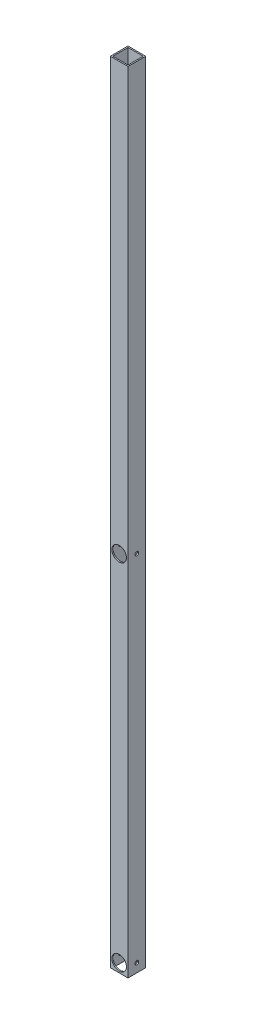
ISO-10303-21;
HEADER;
FILE_DESCRIPTION(('STEP AP214'),'2;1');
FILE_NAME('part.step','',(''),(''),'','','');
FILE_SCHEMA(('AUTOMOTIVE_DESIGN { 1 0 10303 214 1 1 1 1 }'));
ENDSEC;
DATA;
#1=APPLICATION_CONTEXT('core data for automotive mechanical design processes');
#2=APPLICATION_PROTOCOL_DEFINITION('international standard','automotive_design',2000,#1);
#3=PRODUCT_CONTEXT('',#1,'mechanical');
#4=PRODUCT('Part','Part','',(#3));
#5=PRODUCT_RELATED_PRODUCT_CATEGORY('part','',(#4));
#6=PRODUCT_DEFINITION_FORMATION('','',#4);
#7=PRODUCT_DEFINITION_CONTEXT('part definition',#1,'design');
#8=PRODUCT_DEFINITION('design','',#6,#7);
#9=PRODUCT_DEFINITION_SHAPE('','',#8);
#10=(LENGTH_UNIT() NAMED_UNIT(*) SI_UNIT(.MILLI.,.METRE.));
#11=(NAMED_UNIT(*) PLANE_ANGLE_UNIT() SI_UNIT($,.RADIAN.));
#12=(NAMED_UNIT(*) SI_UNIT($,.STERADIAN.) SOLID_ANGLE_UNIT());
#13=UNCERTAINTY_MEASURE_WITH_UNIT(LENGTH_MEASURE(1.E-05),#10,'distance_accuracy_value','');
#14=(GEOMETRIC_REPRESENTATION_CONTEXT(3) GLOBAL_UNCERTAINTY_ASSIGNED_CONTEXT((#13)) GLOBAL_UNIT_ASSIGNED_CONTEXT((#10,
#11,#12)) REPRESENTATION_CONTEXT('',''));
#15=CARTESIAN_POINT('',(0.,0.,0.));
#16=DIRECTION('',(0.,0.,1.));
#17=DIRECTION('',(1.,0.,0.));
#18=AXIS2_PLACEMENT_3D('',#15,#16,#17);
#19=CARTESIAN_POINT('',(0.,1981.2,0.));
#20=DIRECTION('',(0.,-1.,0.));
#21=DIRECTION('',(0.,0.,-1.));
#22=AXIS2_PLACEMENT_3D('',#19,#20,#21);
#23=PLANE('',#22);
#24=DIRECTION('',(0.,0.,1.));
#25=VECTOR('',#24,1.);
#26=CARTESIAN_POINT('',(0.,1981.2,0.));
#27=LINE('',#26,#25);
#28=CARTESIAN_POINT('',(0.,1981.2,-44.45));
#29=VERTEX_POINT('',#28);
#30=CARTESIAN_POINT('',(0.,1981.2,0.));
#31=VERTEX_POINT('',#30);
#32=EDGE_CURVE('E141',#29,#31,#27,.T.);
#33=ORIENTED_EDGE('',*,*,#32,.T.);
#34=DIRECTION('',(1.,0.,0.));
#35=VECTOR('',#34,1.);
#36=CARTESIAN_POINT('',(0.,1981.2,0.));
#37=LINE('',#36,#35);
#38=CARTESIAN_POINT('',(44.45,1981.2,0.));
#39=VERTEX_POINT('',#38);
#40=EDGE_CURVE('E144',#31,#39,#37,.T.);
#41=ORIENTED_EDGE('',*,*,#40,.T.);
#42=DIRECTION('',(0.,0.,-1.));
#43=VECTOR('',#42,1.);
#44=CARTESIAN_POINT('',(44.45,1981.2,0.));
#45=LINE('',#44,#43);
#46=CARTESIAN_POINT('',(44.45,1981.2,-44.45));
#47=VERTEX_POINT('',#46);
#48=EDGE_CURVE('E147',#39,#47,#45,.T.);
#49=ORIENTED_EDGE('',*,*,#48,.T.);
#50=DIRECTION('',(-1.,0.,0.));
#51=VECTOR('',#50,1.);
#52=CARTESIAN_POINT('',(0.,1981.2,-44.45));
#53=LINE('',#52,#51);
#54=EDGE_CURVE('E149',#47,#29,#53,.T.);
#55=ORIENTED_EDGE('',*,*,#54,.T.);
#56=EDGE_LOOP('',(#33,#41,#49,#55));
#57=FACE_BOUND('',#56,.T.);
#58=DIRECTION('',(1.,0.,0.));
#59=VECTOR('',#58,1.);
#60=CARTESIAN_POINT('',(3.175,1981.2,-3.175));
#61=LINE('',#60,#59);
#62=CARTESIAN_POINT('',(3.175,1981.2,-3.175));
#63=VERTEX_POINT('',#62);
#64=CARTESIAN_POINT('',(41.275,1981.2,-3.175));
#65=VERTEX_POINT('',#64);
#66=EDGE_CURVE('E103',#63,#65,#61,.T.);
#67=ORIENTED_EDGE('',*,*,#66,.F.);
#68=DIRECTION('',(0.,0.,1.));
#69=VECTOR('',#68,1.);
#70=CARTESIAN_POINT('',(3.175,1981.2,-3.175));
#71=LINE('',#70,#69);
#72=CARTESIAN_POINT('',(3.175,1981.2,-41.275));
#73=VERTEX_POINT('',#72);
#74=EDGE_CURVE('E125',#73,#63,#71,.T.);
#75=ORIENTED_EDGE('',*,*,#74,.F.);
#76=DIRECTION('',(-1.,0.,0.));
#77=VECTOR('',#76,1.);
#78=CARTESIAN_POINT('',(3.175,1981.2,-41.275));
#79=LINE('',#78,#77);
#80=CARTESIAN_POINT('',(41.275,1981.2,-41.275));
#81=VERTEX_POINT('',#80);
#82=EDGE_CURVE('E123',#81,#73,#79,.T.);
#83=ORIENTED_EDGE('',*,*,#82,.F.);
#84=DIRECTION('',(0.,0.,-1.));
#85=VECTOR('',#84,1.);
#86=CARTESIAN_POINT('',(41.275,1981.2,-3.175));
#87=LINE('',#86,#85);
#88=EDGE_CURVE('E111',#65,#81,#87,.T.);
#89=ORIENTED_EDGE('',*,*,#88,.F.);
#90=EDGE_LOOP('',(#67,#75,#83,#89));
#91=FACE_BOUND('',#90,.T.);
#92=ADVANCED_FACE('F36',(#57,#91),#23,.F.);
#93=CARTESIAN_POINT('',(0.,0.,0.));
#94=DIRECTION('',(0.,-1.,0.));
#95=DIRECTION('',(0.,0.,-1.));
#96=AXIS2_PLACEMENT_3D('',#93,#94,#95);
#97=PLANE('',#96);
#98=DIRECTION('',(0.,0.,1.));
#99=VECTOR('',#98,1.);
#100=CARTESIAN_POINT('',(0.,0.,0.));
#101=LINE('',#100,#99);
#102=CARTESIAN_POINT('',(0.,0.,-44.45));
#103=VERTEX_POINT('',#102);
#104=CARTESIAN_POINT('',(0.,0.,0.));
#105=VERTEX_POINT('',#104);
#106=EDGE_CURVE('E119',#103,#105,#101,.T.);
#107=ORIENTED_EDGE('',*,*,#106,.F.);
#108=DIRECTION('',(-1.,0.,0.));
#109=VECTOR('',#108,1.);
#110=CARTESIAN_POINT('',(0.,0.,-44.45));
#111=LINE('',#110,#109);
#112=CARTESIAN_POINT('',(44.45,0.,-44.45));
#113=VERTEX_POINT('',#112);
#114=EDGE_CURVE('E145',#113,#103,#111,.T.);
#115=ORIENTED_EDGE('',*,*,#114,.F.);
#116=DIRECTION('',(0.,0.,-1.));
#117=VECTOR('',#116,1.);
#118=CARTESIAN_POINT('',(44.45,0.,0.));
#119=LINE('',#118,#117);
#120=CARTESIAN_POINT('',(44.45,0.,0.));
#121=VERTEX_POINT('',#120);
#122=EDGE_CURVE('E156',#121,#113,#119,.T.);
#123=ORIENTED_EDGE('',*,*,#122,.F.);
#124=DIRECTION('',(1.,0.,0.));
#125=VECTOR('',#124,1.);
#126=CARTESIAN_POINT('',(0.,0.,0.));
#127=LINE('',#126,#125);
#128=EDGE_CURVE('E154',#105,#121,#127,.T.);
#129=ORIENTED_EDGE('',*,*,#128,.F.);
#130=EDGE_LOOP('',(#107,#115,#123,#129));
#131=FACE_BOUND('',#130,.T.);
#132=DIRECTION('',(0.,0.,1.));
#133=VECTOR('',#132,1.);
#134=CARTESIAN_POINT('',(3.175,0.,-3.175));
#135=LINE('',#134,#133);
#136=CARTESIAN_POINT('',(3.175,0.,-41.275));
#137=VERTEX_POINT('',#136);
#138=CARTESIAN_POINT('',(3.175,0.,-3.175));
#139=VERTEX_POINT('',#138);
#140=EDGE_CURVE('E112',#137,#139,#135,.T.);
#141=ORIENTED_EDGE('',*,*,#140,.T.);
#142=DIRECTION('',(1.,0.,0.));
#143=VECTOR('',#142,1.);
#144=CARTESIAN_POINT('',(3.175,0.,-3.175));
#145=LINE('',#144,#143);
#146=CARTESIAN_POINT('',(41.275,0.,-3.175));
#147=VERTEX_POINT('',#146);
#148=EDGE_CURVE('E61',#139,#147,#145,.T.);
#149=ORIENTED_EDGE('',*,*,#148,.T.);
#150=DIRECTION('',(0.,0.,-1.));
#151=VECTOR('',#150,1.);
#152=CARTESIAN_POINT('',(41.275,0.,-3.175));
#153=LINE('',#152,#151);
#154=CARTESIAN_POINT('',(41.275,0.,-41.275));
#155=VERTEX_POINT('',#154);
#156=EDGE_CURVE('E118',#147,#155,#153,.T.);
#157=ORIENTED_EDGE('',*,*,#156,.T.);
#158=DIRECTION('',(-1.,0.,0.));
#159=VECTOR('',#158,1.);
#160=CARTESIAN_POINT('',(3.175,0.,-41.275));
#161=LINE('',#160,#159);
#162=EDGE_CURVE('E133',#155,#137,#161,.T.);
#163=ORIENTED_EDGE('',*,*,#162,.T.);
#164=EDGE_LOOP('',(#141,#149,#157,#163));
#165=FACE_BOUND('',#164,.T.);
#166=ADVANCED_FACE('F244',(#131,#165),#97,.T.);
#167=CARTESIAN_POINT('',(0.,1981.2,0.));
#168=DIRECTION('',(1.,0.,0.));
#169=DIRECTION('',(0.,0.,-1.));
#170=AXIS2_PLACEMENT_3D('',#167,#168,#169);
#171=PLANE('',#170);
#172=CARTESIAN_POINT('',(0.,22.2249999999999,-22.225));
#173=DIRECTION('',(1.,0.,0.));
#174=DIRECTION('',(0.,0.,-1.));
#175=AXIS2_PLACEMENT_3D('',#172,#173,#174);
#176=CIRCLE('',#175,4.7625);
#177=CARTESIAN_POINT('',(0.,22.2249999999999,-26.9875));
#178=VERTEX_POINT('',#177);
#179=EDGE_CURVE('E176',#178,#178,#176,.T.);
#180=ORIENTED_EDGE('',*,*,#179,.T.);
#181=EDGE_LOOP('',(#180));
#182=FACE_BOUND('',#181,.T.);
#183=CARTESIAN_POINT('',(0.,911.225,-22.225));
#184=DIRECTION('',(1.,0.,0.));
#185=DIRECTION('',(0.,0.,-1.));
#186=AXIS2_PLACEMENT_3D('',#183,#184,#185);
#187=CIRCLE('',#186,4.76250000000002);
#188=CARTESIAN_POINT('',(0.,911.225,-26.9875));
#189=VERTEX_POINT('',#188);
#190=EDGE_CURVE('E187',#189,#189,#187,.T.);
#191=ORIENTED_EDGE('',*,*,#190,.T.);
#192=EDGE_LOOP('',(#191));
#193=FACE_BOUND('',#192,.T.);
#194=ORIENTED_EDGE('',*,*,#106,.T.);
#195=DIRECTION('',(0.,-1.,0.));
#196=VECTOR('',#195,1.);
#197=CARTESIAN_POINT('',(0.,1981.2,0.));
#198=LINE('',#197,#196);
#199=EDGE_CURVE('E11',#31,#105,#198,.T.);
#200=ORIENTED_EDGE('',*,*,#199,.F.);
#201=ORIENTED_EDGE('',*,*,#32,.F.);
#202=DIRECTION('',(0.,-1.,0.));
#203=VECTOR('',#202,1.);
#204=CARTESIAN_POINT('',(0.,1981.2,-44.45));
#205=LINE('',#204,#203);
#206=EDGE_CURVE('E151',#29,#103,#205,.T.);
#207=ORIENTED_EDGE('',*,*,#206,.T.);
#208=EDGE_LOOP('',(#194,#200,#201,#207));
#209=FACE_BOUND('',#208,.T.);
#210=ADVANCED_FACE('F38',(#182,#193,#209),#171,.F.);
#211=CARTESIAN_POINT('',(0.,1981.2,0.));
#212=DIRECTION('',(0.,0.,-1.));
#213=DIRECTION('',(-1.,0.,0.));
#214=AXIS2_PLACEMENT_3D('',#211,#212,#213);
#215=PLANE('',#214);
#216=CARTESIAN_POINT('',(22.225,22.2249999999999,0.));
#217=DIRECTION('',(0.,0.,1.));
#218=DIRECTION('',(1.,0.,0.));
#219=AXIS2_PLACEMENT_3D('',#216,#217,#218);
#220=CIRCLE('',#219,18.25625);
#221=CARTESIAN_POINT('',(40.48125,22.2249999999999,0.));
#222=VERTEX_POINT('',#221);
#223=EDGE_CURVE('E201',#222,#222,#220,.T.);
#224=ORIENTED_EDGE('',*,*,#223,.F.);
#225=EDGE_LOOP('',(#224));
#226=FACE_BOUND('',#225,.T.);
#227=CARTESIAN_POINT('',(22.225,911.225,0.));
#228=DIRECTION('',(0.,0.,1.));
#229=DIRECTION('',(1.,0.,0.));
#230=AXIS2_PLACEMENT_3D('',#227,#228,#229);
#231=CIRCLE('',#230,18.25625);
#232=CARTESIAN_POINT('',(40.48125,911.225,0.));
#233=VERTEX_POINT('',#232);
#234=EDGE_CURVE('E198',#233,#233,#231,.T.);
#235=ORIENTED_EDGE('',*,*,#234,.F.);
#236=EDGE_LOOP('',(#235));
#237=FACE_BOUND('',#236,.T.);
#238=ORIENTED_EDGE('',*,*,#128,.T.);
#239=DIRECTION('',(0.,-1.,0.));
#240=VECTOR('',#239,1.);
#241=CARTESIAN_POINT('',(44.45,1981.2,0.));
#242=LINE('',#241,#240);
#243=EDGE_CURVE('E45',#39,#121,#242,.T.);
#244=ORIENTED_EDGE('',*,*,#243,.F.);
#245=ORIENTED_EDGE('',*,*,#40,.F.);
#246=ORIENTED_EDGE('',*,*,#199,.T.);
#247=EDGE_LOOP('',(#238,#244,#245,#246));
#248=FACE_BOUND('',#247,.T.);
#249=ADVANCED_FACE('F230',(#226,#237,#248),#215,.F.);
#250=CARTESIAN_POINT('',(44.45,1981.2,0.));
#251=DIRECTION('',(-1.,0.,0.));
#252=DIRECTION('',(0.,0.,1.));
#253=AXIS2_PLACEMENT_3D('',#250,#251,#252);
#254=PLANE('',#253);
#255=CARTESIAN_POINT('',(44.45,22.2249999999999,-22.225));
#256=DIRECTION('',(1.,0.,0.));
#257=DIRECTION('',(0.,0.,-1.));
#258=AXIS2_PLACEMENT_3D('',#255,#256,#257);
#259=CIRCLE('',#258,4.7625);
#260=CARTESIAN_POINT('',(44.45,22.2249999999999,-26.9875));
#261=VERTEX_POINT('',#260);
#262=EDGE_CURVE('E182',#261,#261,#259,.T.);
#263=ORIENTED_EDGE('',*,*,#262,.F.);
#264=EDGE_LOOP('',(#263));
#265=FACE_BOUND('',#264,.T.);
#266=CARTESIAN_POINT('',(44.45,911.225,-22.225));
#267=DIRECTION('',(1.,0.,0.));
#268=DIRECTION('',(0.,0.,-1.));
#269=AXIS2_PLACEMENT_3D('',#266,#267,#268);
#270=CIRCLE('',#269,4.76250000000002);
#271=CARTESIAN_POINT('',(44.45,911.225,-26.9875));
#272=VERTEX_POINT('',#271);
#273=EDGE_CURVE('E192',#272,#272,#270,.T.);
#274=ORIENTED_EDGE('',*,*,#273,.F.);
#275=EDGE_LOOP('',(#274));
#276=FACE_BOUND('',#275,.T.);
#277=ORIENTED_EDGE('',*,*,#122,.T.);
#278=DIRECTION('',(0.,-1.,0.));
#279=VECTOR('',#278,1.);
#280=CARTESIAN_POINT('',(44.45,1981.2,-44.45));
#281=LINE('',#280,#279);
#282=EDGE_CURVE('E161',#47,#113,#281,.T.);
#283=ORIENTED_EDGE('',*,*,#282,.F.);
#284=ORIENTED_EDGE('',*,*,#48,.F.);
#285=ORIENTED_EDGE('',*,*,#243,.T.);
#286=EDGE_LOOP('',(#277,#283,#284,#285));
#287=FACE_BOUND('',#286,.T.);
#288=ADVANCED_FACE('F233',(#265,#276,#287),#254,.F.);
#289=CARTESIAN_POINT('',(0.,1981.2,-44.45));
#290=DIRECTION('',(0.,0.,1.));
#291=DIRECTION('',(1.,0.,0.));
#292=AXIS2_PLACEMENT_3D('',#289,#290,#291);
#293=PLANE('',#292);
#294=CARTESIAN_POINT('',(22.225,22.2249999999999,-44.45));
#295=DIRECTION('',(0.,0.,1.));
#296=DIRECTION('',(1.,0.,0.));
#297=AXIS2_PLACEMENT_3D('',#294,#295,#296);
#298=CIRCLE('',#297,18.25625);
#299=CARTESIAN_POINT('',(40.48125,22.2249999999999,-44.45));
#300=VERTEX_POINT('',#299);
#301=EDGE_CURVE('E170',#300,#300,#298,.T.);
#302=ORIENTED_EDGE('',*,*,#301,.T.);
#303=EDGE_LOOP('',(#302));
#304=FACE_BOUND('',#303,.T.);
#305=CARTESIAN_POINT('',(22.225,911.225,-44.45));
#306=DIRECTION('',(0.,0.,1.));
#307=DIRECTION('',(1.,0.,0.));
#308=AXIS2_PLACEMENT_3D('',#305,#306,#307);
#309=CIRCLE('',#308,18.25625);
#310=CARTESIAN_POINT('',(40.48125,911.225,-44.45));
#311=VERTEX_POINT('',#310);
#312=EDGE_CURVE('E204',#311,#311,#309,.T.);
#313=ORIENTED_EDGE('',*,*,#312,.T.);
#314=EDGE_LOOP('',(#313));
#315=FACE_BOUND('',#314,.T.);
#316=ORIENTED_EDGE('',*,*,#114,.T.);
#317=ORIENTED_EDGE('',*,*,#206,.F.);
#318=ORIENTED_EDGE('',*,*,#54,.F.);
#319=ORIENTED_EDGE('',*,*,#282,.T.);
#320=EDGE_LOOP('',(#316,#317,#318,#319));
#321=FACE_BOUND('',#320,.T.);
#322=ADVANCED_FACE('F218',(#304,#315,#321),#293,.F.);
#323=CARTESIAN_POINT('',(3.175,1981.2,-3.175));
#324=DIRECTION('',(0.,0.,-1.));
#325=DIRECTION('',(-1.,0.,0.));
#326=AXIS2_PLACEMENT_3D('',#323,#324,#325);
#327=PLANE('',#326);
#328=CARTESIAN_POINT('',(22.225,22.2249999999999,-3.175));
#329=DIRECTION('',(0.,0.,-1.));
#330=DIRECTION('',(-1.,0.,0.));
#331=AXIS2_PLACEMENT_3D('',#328,#329,#330);
#332=CIRCLE('',#331,18.25625);
#333=CARTESIAN_POINT('',(3.96875,22.2249999999999,-3.175));
#334=VERTEX_POINT('',#333);
#335=EDGE_CURVE('E131',#334,#334,#332,.T.);
#336=ORIENTED_EDGE('',*,*,#335,.F.);
#337=EDGE_LOOP('',(#336));
#338=FACE_BOUND('',#337,.T.);
#339=CARTESIAN_POINT('',(22.225,911.225,-3.175));
#340=DIRECTION('',(0.,0.,-1.));
#341=DIRECTION('',(-1.,0.,0.));
#342=AXIS2_PLACEMENT_3D('',#339,#340,#341);
#343=CIRCLE('',#342,18.25625);
#344=CARTESIAN_POINT('',(3.96874999999999,911.225,-3.175));
#345=VERTEX_POINT('',#344);
#346=EDGE_CURVE('E169',#345,#345,#343,.T.);
#347=ORIENTED_EDGE('',*,*,#346,.F.);
#348=EDGE_LOOP('',(#347));
#349=FACE_BOUND('',#348,.T.);
#350=ORIENTED_EDGE('',*,*,#148,.F.);
#351=DIRECTION('',(0.,-1.,0.));
#352=VECTOR('',#351,1.);
#353=CARTESIAN_POINT('',(3.175,1981.2,-3.175));
#354=LINE('',#353,#352);
#355=EDGE_CURVE('E107',#63,#139,#354,.T.);
#356=ORIENTED_EDGE('',*,*,#355,.F.);
#357=ORIENTED_EDGE('',*,*,#66,.T.);
#358=DIRECTION('',(0.,-1.,0.));
#359=VECTOR('',#358,1.);
#360=CARTESIAN_POINT('',(41.275,1981.2,-3.175));
#361=LINE('',#360,#359);
#362=EDGE_CURVE('E106',#65,#147,#361,.T.);
#363=ORIENTED_EDGE('',*,*,#362,.T.);
#364=EDGE_LOOP('',(#350,#356,#357,#363));
#365=FACE_BOUND('',#364,.T.);
#366=ADVANCED_FACE('F105',(#338,#349,#365),#327,.T.);
#367=CARTESIAN_POINT('',(41.275,1981.2,-3.175));
#368=DIRECTION('',(-1.,0.,0.));
#369=DIRECTION('',(0.,0.,1.));
#370=AXIS2_PLACEMENT_3D('',#367,#368,#369);
#371=PLANE('',#370);
#372=CARTESIAN_POINT('',(41.275,22.2249999999999,-22.225));
#373=DIRECTION('',(-1.,0.,0.));
#374=DIRECTION('',(0.,0.,1.));
#375=AXIS2_PLACEMENT_3D('',#372,#373,#374);
#376=CIRCLE('',#375,4.7625);
#377=CARTESIAN_POINT('',(41.275,22.2249999999999,-17.4625));
#378=VERTEX_POINT('',#377);
#379=EDGE_CURVE('E195',#378,#378,#376,.T.);
#380=ORIENTED_EDGE('',*,*,#379,.F.);
#381=EDGE_LOOP('',(#380));
#382=FACE_BOUND('',#381,.T.);
#383=CARTESIAN_POINT('',(41.275,911.225,-22.225));
#384=DIRECTION('',(-1.,0.,0.));
#385=DIRECTION('',(0.,0.,1.));
#386=AXIS2_PLACEMENT_3D('',#383,#384,#385);
#387=CIRCLE('',#386,4.76250000000002);
#388=CARTESIAN_POINT('',(41.275,911.225,-17.4625));
#389=VERTEX_POINT('',#388);
#390=EDGE_CURVE('E175',#389,#389,#387,.T.);
#391=ORIENTED_EDGE('',*,*,#390,.F.);
#392=EDGE_LOOP('',(#391));
#393=FACE_BOUND('',#392,.T.);
#394=ORIENTED_EDGE('',*,*,#156,.F.);
#395=ORIENTED_EDGE('',*,*,#362,.F.);
#396=ORIENTED_EDGE('',*,*,#88,.T.);
#397=DIRECTION('',(0.,-1.,0.));
#398=VECTOR('',#397,1.);
#399=CARTESIAN_POINT('',(41.275,1981.2,-41.275));
#400=LINE('',#399,#398);
#401=EDGE_CURVE('E120',#81,#155,#400,.T.);
#402=ORIENTED_EDGE('',*,*,#401,.T.);
#403=EDGE_LOOP('',(#394,#395,#396,#402));
#404=FACE_BOUND('',#403,.T.);
#405=ADVANCED_FACE('F115',(#382,#393,#404),#371,.T.);
#406=CARTESIAN_POINT('',(3.175,1981.2,-41.275));
#407=DIRECTION('',(0.,0.,1.));
#408=DIRECTION('',(1.,0.,0.));
#409=AXIS2_PLACEMENT_3D('',#406,#407,#408);
#410=PLANE('',#409);
#411=CARTESIAN_POINT('',(22.225,22.2249999999999,-41.275));
#412=DIRECTION('',(0.,0.,1.));
#413=DIRECTION('',(1.,0.,0.));
#414=AXIS2_PLACEMENT_3D('',#411,#412,#413);
#415=CIRCLE('',#414,18.25625);
#416=CARTESIAN_POINT('',(40.48125,22.2249999999999,-41.275));
#417=VERTEX_POINT('',#416);
#418=EDGE_CURVE('E171',#417,#417,#415,.T.);
#419=ORIENTED_EDGE('',*,*,#418,.F.);
#420=EDGE_LOOP('',(#419));
#421=FACE_BOUND('',#420,.T.);
#422=CARTESIAN_POINT('',(22.225,911.225,-41.275));
#423=DIRECTION('',(0.,0.,1.));
#424=DIRECTION('',(1.,0.,0.));
#425=AXIS2_PLACEMENT_3D('',#422,#423,#424);
#426=CIRCLE('',#425,18.25625);
#427=CARTESIAN_POINT('',(40.48125,911.225,-41.275));
#428=VERTEX_POINT('',#427);
#429=EDGE_CURVE('E166',#428,#428,#426,.T.);
#430=ORIENTED_EDGE('',*,*,#429,.F.);
#431=EDGE_LOOP('',(#430));
#432=FACE_BOUND('',#431,.T.);
#433=ORIENTED_EDGE('',*,*,#162,.F.);
#434=ORIENTED_EDGE('',*,*,#401,.F.);
#435=ORIENTED_EDGE('',*,*,#82,.T.);
#436=DIRECTION('',(0.,-1.,0.));
#437=VECTOR('',#436,1.);
#438=CARTESIAN_POINT('',(3.175,1981.2,-41.275));
#439=LINE('',#438,#437);
#440=EDGE_CURVE('E53',#73,#137,#439,.T.);
#441=ORIENTED_EDGE('',*,*,#440,.T.);
#442=EDGE_LOOP('',(#433,#434,#435,#441));
#443=FACE_BOUND('',#442,.T.);
#444=ADVANCED_FACE('F327',(#421,#432,#443),#410,.T.);
#445=CARTESIAN_POINT('',(3.175,1981.2,-3.175));
#446=DIRECTION('',(1.,0.,0.));
#447=DIRECTION('',(0.,0.,-1.));
#448=AXIS2_PLACEMENT_3D('',#445,#446,#447);
#449=PLANE('',#448);
#450=CARTESIAN_POINT('',(3.175,22.2249999999999,-22.225));
#451=DIRECTION('',(1.,0.,0.));
#452=DIRECTION('',(0.,0.,-1.));
#453=AXIS2_PLACEMENT_3D('',#450,#451,#452);
#454=CIRCLE('',#453,4.7625);
#455=CARTESIAN_POINT('',(3.175,22.2249999999999,-26.9875));
#456=VERTEX_POINT('',#455);
#457=EDGE_CURVE('E40',#456,#456,#454,.T.);
#458=ORIENTED_EDGE('',*,*,#457,.F.);
#459=EDGE_LOOP('',(#458));
#460=FACE_BOUND('',#459,.T.);
#461=CARTESIAN_POINT('',(3.175,911.225,-22.225));
#462=DIRECTION('',(1.,0.,0.));
#463=DIRECTION('',(0.,0.,-1.));
#464=AXIS2_PLACEMENT_3D('',#461,#462,#463);
#465=CIRCLE('',#464,4.76250000000002);
#466=CARTESIAN_POINT('',(3.175,911.225,-26.9875));
#467=VERTEX_POINT('',#466);
#468=EDGE_CURVE('E173',#467,#467,#465,.T.);
#469=ORIENTED_EDGE('',*,*,#468,.F.);
#470=EDGE_LOOP('',(#469));
#471=FACE_BOUND('',#470,.T.);
#472=ORIENTED_EDGE('',*,*,#140,.F.);
#473=ORIENTED_EDGE('',*,*,#440,.F.);
#474=ORIENTED_EDGE('',*,*,#74,.T.);
#475=ORIENTED_EDGE('',*,*,#355,.T.);
#476=EDGE_LOOP('',(#472,#473,#474,#475));
#477=FACE_BOUND('',#476,.T.);
#478=ADVANCED_FACE('F336',(#460,#471,#477),#449,.T.);
#479=CARTESIAN_POINT('',(22.225,911.225,-44.45));
#480=DIRECTION('',(0.,0.,1.));
#481=DIRECTION('',(1.,0.,0.));
#482=AXIS2_PLACEMENT_3D('',#479,#480,#481);
#483=CYLINDRICAL_SURFACE('',#482,18.25625);
#484=ORIENTED_EDGE('',*,*,#429,.T.);
#485=EDGE_LOOP('',(#484));
#486=FACE_BOUND('',#485,.T.);
#487=ORIENTED_EDGE('',*,*,#312,.F.);
#488=EDGE_LOOP('',(#487));
#489=FACE_BOUND('',#488,.T.);
#490=ADVANCED_FACE('F227',(#486,#489),#483,.F.);
#491=CARTESIAN_POINT('',(22.225,22.2249999999999,-44.45));
#492=DIRECTION('',(0.,0.,1.));
#493=DIRECTION('',(1.,0.,0.));
#494=AXIS2_PLACEMENT_3D('',#491,#492,#493);
#495=CYLINDRICAL_SURFACE('',#494,18.25625);
#496=ORIENTED_EDGE('',*,*,#418,.T.);
#497=EDGE_LOOP('',(#496));
#498=FACE_BOUND('',#497,.T.);
#499=ORIENTED_EDGE('',*,*,#301,.F.);
#500=EDGE_LOOP('',(#499));
#501=FACE_BOUND('',#500,.T.);
#502=ADVANCED_FACE('F225',(#498,#501),#495,.F.);
#503=ORIENTED_EDGE('',*,*,#346,.T.);
#504=EDGE_LOOP('',(#503));
#505=FACE_BOUND('',#504,.T.);
#506=ORIENTED_EDGE('',*,*,#234,.T.);
#507=EDGE_LOOP('',(#506));
#508=FACE_BOUND('',#507,.T.);
#509=ADVANCED_FACE('F222',(#505,#508),#483,.F.);
#510=ORIENTED_EDGE('',*,*,#335,.T.);
#511=EDGE_LOOP('',(#510));
#512=FACE_BOUND('',#511,.T.);
#513=ORIENTED_EDGE('',*,*,#223,.T.);
#514=EDGE_LOOP('',(#513));
#515=FACE_BOUND('',#514,.T.);
#516=ADVANCED_FACE('F213',(#512,#515),#495,.F.);
#517=CARTESIAN_POINT('',(0.,911.225,-22.225));
#518=DIRECTION('',(1.,0.,0.));
#519=DIRECTION('',(0.,0.,-1.));
#520=AXIS2_PLACEMENT_3D('',#517,#518,#519);
#521=CYLINDRICAL_SURFACE('',#520,4.76250000000002);
#522=ORIENTED_EDGE('',*,*,#468,.T.);
#523=EDGE_LOOP('',(#522));
#524=FACE_BOUND('',#523,.T.);
#525=ORIENTED_EDGE('',*,*,#190,.F.);
#526=EDGE_LOOP('',(#525));
#527=FACE_BOUND('',#526,.T.);
#528=ADVANCED_FACE('F277',(#524,#527),#521,.F.);
#529=CARTESIAN_POINT('',(0.,22.2249999999999,-22.225));
#530=DIRECTION('',(1.,0.,0.));
#531=DIRECTION('',(0.,0.,-1.));
#532=AXIS2_PLACEMENT_3D('',#529,#530,#531);
#533=CYLINDRICAL_SURFACE('',#532,4.7625);
#534=ORIENTED_EDGE('',*,*,#457,.T.);
#535=EDGE_LOOP('',(#534));
#536=FACE_BOUND('',#535,.T.);
#537=ORIENTED_EDGE('',*,*,#179,.F.);
#538=EDGE_LOOP('',(#537));
#539=FACE_BOUND('',#538,.T.);
#540=ADVANCED_FACE('F274',(#536,#539),#533,.F.);
#541=ORIENTED_EDGE('',*,*,#390,.T.);
#542=EDGE_LOOP('',(#541));
#543=FACE_BOUND('',#542,.T.);
#544=ORIENTED_EDGE('',*,*,#273,.T.);
#545=EDGE_LOOP('',(#544));
#546=FACE_BOUND('',#545,.T.);
#547=ADVANCED_FACE('F271',(#543,#546),#521,.F.);
#548=ORIENTED_EDGE('',*,*,#379,.T.);
#549=EDGE_LOOP('',(#548));
#550=FACE_BOUND('',#549,.T.);
#551=ORIENTED_EDGE('',*,*,#262,.T.);
#552=EDGE_LOOP('',(#551));
#553=FACE_BOUND('',#552,.T.);
#554=ADVANCED_FACE('F273',(#550,#553),#533,.F.);
#555=CLOSED_SHELL('',(#92,#166,#210,#249,#288,#322,#366,#405,#444,#478,#490,#502,#509,#516,#528,
#540,#547,#554));
#556=MANIFOLD_SOLID_BREP('B2',#555);
#557=ADVANCED_BREP_SHAPE_REPRESENTATION('',(#18,#556),#14);
#558=SHAPE_DEFINITION_REPRESENTATION(#9,#557);
ENDSEC;
END-ISO-10303-21;
